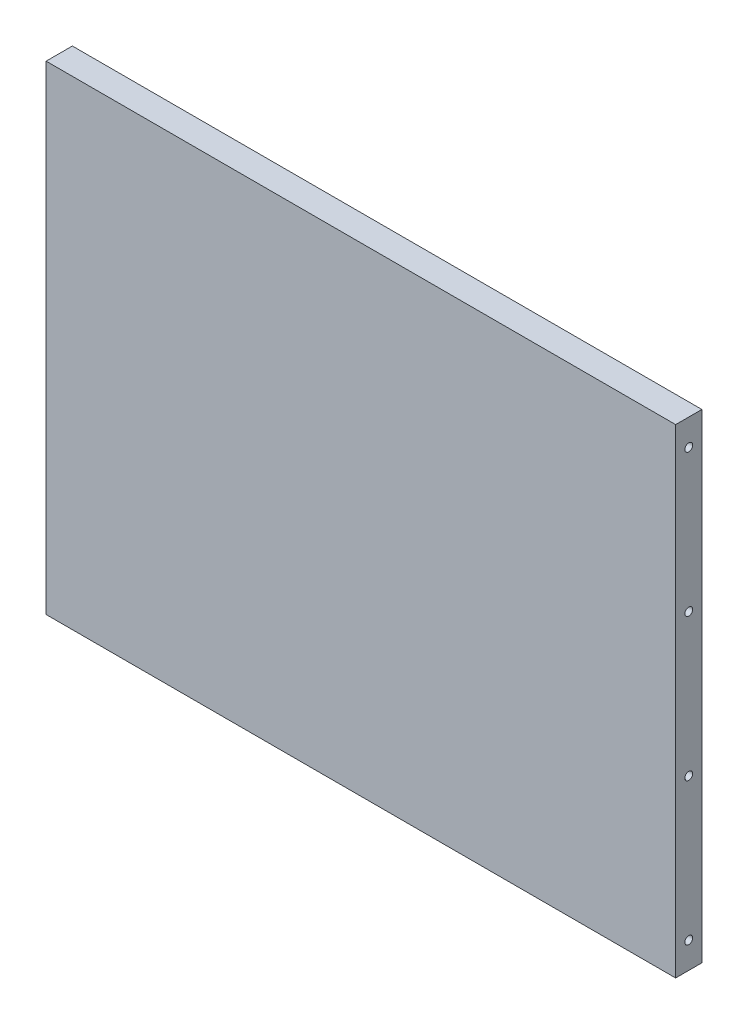
ISO-10303-21;
HEADER;
FILE_DESCRIPTION(('STEP AP214'),'2;1');
FILE_NAME('part.step','',(''),(''),'','','');
FILE_SCHEMA(('AUTOMOTIVE_DESIGN { 1 0 10303 214 1 1 1 1 }'));
ENDSEC;
DATA;
#1=APPLICATION_CONTEXT('core data for automotive mechanical design processes');
#2=APPLICATION_PROTOCOL_DEFINITION('international standard','automotive_design',2000,#1);
#3=PRODUCT_CONTEXT('',#1,'mechanical');
#4=PRODUCT('Part','Part','',(#3));
#5=PRODUCT_RELATED_PRODUCT_CATEGORY('part','',(#4));
#6=PRODUCT_DEFINITION_FORMATION('','',#4);
#7=PRODUCT_DEFINITION_CONTEXT('part definition',#1,'design');
#8=PRODUCT_DEFINITION('design','',#6,#7);
#9=PRODUCT_DEFINITION_SHAPE('','',#8);
#10=(LENGTH_UNIT() NAMED_UNIT(*) SI_UNIT(.MILLI.,.METRE.));
#11=(NAMED_UNIT(*) PLANE_ANGLE_UNIT() SI_UNIT($,.RADIAN.));
#12=(NAMED_UNIT(*) SI_UNIT($,.STERADIAN.) SOLID_ANGLE_UNIT());
#13=UNCERTAINTY_MEASURE_WITH_UNIT(LENGTH_MEASURE(1.E-05),#10,'distance_accuracy_value','');
#14=(GEOMETRIC_REPRESENTATION_CONTEXT(3) GLOBAL_UNCERTAINTY_ASSIGNED_CONTEXT((#13)) GLOBAL_UNIT_ASSIGNED_CONTEXT((#10,
#11,#12)) REPRESENTATION_CONTEXT('',''));
#15=CARTESIAN_POINT('',(0.,0.,0.));
#16=DIRECTION('',(0.,0.,1.));
#17=DIRECTION('',(1.,0.,0.));
#18=AXIS2_PLACEMENT_3D('',#15,#16,#17);
#19=CARTESIAN_POINT('',(-152.39999933097,-116.025,-12.7));
#20=DIRECTION('',(-1.,0.,0.));
#21=DIRECTION('',(0.,0.,1.));
#22=AXIS2_PLACEMENT_3D('',#19,#20,#21);
#23=PLANE('',#22);
#24=CARTESIAN_POINT('',(-152.39999933097,103.325,-6.34999999999997));
#25=DIRECTION('',(-1.,0.,0.));
#26=DIRECTION('',(0.,0.,1.));
#27=AXIS2_PLACEMENT_3D('',#24,#25,#26);
#28=CIRCLE('',#27,1.89864999999999);
#29=CARTESIAN_POINT('',(-152.39999933097,103.325,-4.45134999999998));
#30=VERTEX_POINT('',#29);
#31=EDGE_CURVE('E154',#30,#30,#28,.T.);
#32=ORIENTED_EDGE('',*,*,#31,.F.);
#33=EDGE_LOOP('',(#32));
#34=FACE_BOUND('',#33,.T.);
#35=CARTESIAN_POINT('',(-152.39999933097,34.4416666666666,-6.34999999999997));
#36=DIRECTION('',(-1.,0.,0.));
#37=DIRECTION('',(0.,0.,1.));
#38=AXIS2_PLACEMENT_3D('',#35,#36,#37);
#39=CIRCLE('',#38,1.89864999999999);
#40=CARTESIAN_POINT('',(-152.39999933097,34.4416666666666,-4.45134999999998));
#41=VERTEX_POINT('',#40);
#42=EDGE_CURVE('E160',#41,#41,#39,.T.);
#43=ORIENTED_EDGE('',*,*,#42,.F.);
#44=EDGE_LOOP('',(#43));
#45=FACE_BOUND('',#44,.T.);
#46=CARTESIAN_POINT('',(-152.39999933097,-34.4416666666667,-6.34999999999997));
#47=DIRECTION('',(-1.,0.,0.));
#48=DIRECTION('',(0.,0.,1.));
#49=AXIS2_PLACEMENT_3D('',#46,#47,#48);
#50=CIRCLE('',#49,1.89864999999999);
#51=CARTESIAN_POINT('',(-152.39999933097,-34.4416666666667,-4.45134999999998));
#52=VERTEX_POINT('',#51);
#53=EDGE_CURVE('E166',#52,#52,#50,.T.);
#54=ORIENTED_EDGE('',*,*,#53,.F.);
#55=EDGE_LOOP('',(#54));
#56=FACE_BOUND('',#55,.T.);
#57=CARTESIAN_POINT('',(-152.39999933097,-103.325,-6.34999999999997));
#58=DIRECTION('',(-1.,0.,0.));
#59=DIRECTION('',(0.,0.,1.));
#60=AXIS2_PLACEMENT_3D('',#57,#58,#59);
#61=CIRCLE('',#60,1.89864999999999);
#62=CARTESIAN_POINT('',(-152.39999933097,-103.325,-4.45134999999998));
#63=VERTEX_POINT('',#62);
#64=EDGE_CURVE('E172',#63,#63,#61,.T.);
#65=ORIENTED_EDGE('',*,*,#64,.F.);
#66=EDGE_LOOP('',(#65));
#67=FACE_BOUND('',#66,.T.);
#68=DIRECTION('',(0.,-1.,0.));
#69=VECTOR('',#68,1.);
#70=CARTESIAN_POINT('',(-152.39999933097,-116.025,0.));
#71=LINE('',#70,#69);
#72=CARTESIAN_POINT('',(-152.39999933097,116.025,0.));
#73=VERTEX_POINT('',#72);
#74=CARTESIAN_POINT('',(-152.39999933097,-116.025,0.));
#75=VERTEX_POINT('',#74);
#76=EDGE_CURVE('E178',#73,#75,#71,.T.);
#77=ORIENTED_EDGE('',*,*,#76,.F.);
#78=DIRECTION('',(0.,0.,1.));
#79=VECTOR('',#78,1.);
#80=CARTESIAN_POINT('',(-152.39999933097,116.025,-12.7));
#81=LINE('',#80,#79);
#82=CARTESIAN_POINT('',(-152.39999933097,116.025,-12.7));
#83=VERTEX_POINT('',#82);
#84=EDGE_CURVE('E11',#83,#73,#81,.T.);
#85=ORIENTED_EDGE('',*,*,#84,.F.);
#86=DIRECTION('',(0.,-1.,0.));
#87=VECTOR('',#86,1.);
#88=CARTESIAN_POINT('',(-152.39999933097,-116.025,-12.7));
#89=LINE('',#88,#87);
#90=CARTESIAN_POINT('',(-152.39999933097,-116.025,-12.7));
#91=VERTEX_POINT('',#90);
#92=EDGE_CURVE('E179',#83,#91,#89,.T.);
#93=ORIENTED_EDGE('',*,*,#92,.T.);
#94=DIRECTION('',(0.,0.,1.));
#95=VECTOR('',#94,1.);
#96=CARTESIAN_POINT('',(-152.39999933097,-116.025,-12.7));
#97=LINE('',#96,#95);
#98=EDGE_CURVE('E54',#91,#75,#97,.T.);
#99=ORIENTED_EDGE('',*,*,#98,.T.);
#100=EDGE_LOOP('',(#77,#85,#93,#99));
#101=FACE_BOUND('',#100,.T.);
#102=ADVANCED_FACE('F51',(#34,#45,#56,#67,#101),#23,.T.);
#103=CARTESIAN_POINT('',(-152.39999933097,116.025,-12.7));
#104=DIRECTION('',(0.,1.,0.));
#105=DIRECTION('',(0.,0.,1.));
#106=AXIS2_PLACEMENT_3D('',#103,#104,#105);
#107=PLANE('',#106);
#108=DIRECTION('',(-1.,0.,0.));
#109=VECTOR('',#108,1.);
#110=CARTESIAN_POINT('',(-152.39999933097,116.025,0.));
#111=LINE('',#110,#109);
#112=CARTESIAN_POINT('',(152.39999933097,116.025,0.));
#113=VERTEX_POINT('',#112);
#114=EDGE_CURVE('E182',#113,#73,#111,.T.);
#115=ORIENTED_EDGE('',*,*,#114,.F.);
#116=DIRECTION('',(0.,0.,1.));
#117=VECTOR('',#116,1.);
#118=CARTESIAN_POINT('',(152.39999933097,116.025,-12.7));
#119=LINE('',#118,#117);
#120=CARTESIAN_POINT('',(152.39999933097,116.025,-12.7));
#121=VERTEX_POINT('',#120);
#122=EDGE_CURVE('E60',#121,#113,#119,.T.);
#123=ORIENTED_EDGE('',*,*,#122,.F.);
#124=DIRECTION('',(-1.,0.,0.));
#125=VECTOR('',#124,1.);
#126=CARTESIAN_POINT('',(-152.39999933097,116.025,-12.7));
#127=LINE('',#126,#125);
#128=EDGE_CURVE('E186',#121,#83,#127,.T.);
#129=ORIENTED_EDGE('',*,*,#128,.T.);
#130=ORIENTED_EDGE('',*,*,#84,.T.);
#131=EDGE_LOOP('',(#115,#123,#129,#130));
#132=FACE_BOUND('',#131,.T.);
#133=ADVANCED_FACE('F201',(#132),#107,.T.);
#134=CARTESIAN_POINT('',(152.39999933097,-116.025,-12.7));
#135=DIRECTION('',(1.,0.,0.));
#136=DIRECTION('',(0.,0.,-1.));
#137=AXIS2_PLACEMENT_3D('',#134,#135,#136);
#138=PLANE('',#137);
#139=CARTESIAN_POINT('',(152.39999933097,103.325,-6.34999999999997));
#140=DIRECTION('',(1.,0.,0.));
#141=DIRECTION('',(0.,0.,-1.));
#142=AXIS2_PLACEMENT_3D('',#139,#140,#141);
#143=CIRCLE('',#142,1.89864999999999);
#144=CARTESIAN_POINT('',(152.39999933097,103.325,-8.24864999999996));
#145=VERTEX_POINT('',#144);
#146=EDGE_CURVE('E132',#145,#145,#143,.T.);
#147=ORIENTED_EDGE('',*,*,#146,.F.);
#148=EDGE_LOOP('',(#147));
#149=FACE_BOUND('',#148,.T.);
#150=CARTESIAN_POINT('',(152.39999933097,34.4416666666666,-6.34999999999997));
#151=DIRECTION('',(1.,0.,0.));
#152=DIRECTION('',(0.,0.,-1.));
#153=AXIS2_PLACEMENT_3D('',#150,#151,#152);
#154=CIRCLE('',#153,1.89864999999999);
#155=CARTESIAN_POINT('',(152.39999933097,34.4416666666666,-8.24864999999996));
#156=VERTEX_POINT('',#155);
#157=EDGE_CURVE('E131',#156,#156,#154,.T.);
#158=ORIENTED_EDGE('',*,*,#157,.F.);
#159=EDGE_LOOP('',(#158));
#160=FACE_BOUND('',#159,.T.);
#161=CARTESIAN_POINT('',(152.39999933097,-34.4416666666667,-6.34999999999997));
#162=DIRECTION('',(1.,0.,0.));
#163=DIRECTION('',(0.,0.,-1.));
#164=AXIS2_PLACEMENT_3D('',#161,#162,#163);
#165=CIRCLE('',#164,1.89864999999999);
#166=CARTESIAN_POINT('',(152.39999933097,-34.4416666666667,-8.24864999999996));
#167=VERTEX_POINT('',#166);
#168=EDGE_CURVE('E142',#167,#167,#165,.T.);
#169=ORIENTED_EDGE('',*,*,#168,.F.);
#170=EDGE_LOOP('',(#169));
#171=FACE_BOUND('',#170,.T.);
#172=CARTESIAN_POINT('',(152.39999933097,-103.325,-6.34999999999997));
#173=DIRECTION('',(1.,0.,0.));
#174=DIRECTION('',(0.,0.,-1.));
#175=AXIS2_PLACEMENT_3D('',#172,#173,#174);
#176=CIRCLE('',#175,1.89864999999999);
#177=CARTESIAN_POINT('',(152.39999933097,-103.325,-8.24864999999996));
#178=VERTEX_POINT('',#177);
#179=EDGE_CURVE('E148',#178,#178,#176,.T.);
#180=ORIENTED_EDGE('',*,*,#179,.F.);
#181=EDGE_LOOP('',(#180));
#182=FACE_BOUND('',#181,.T.);
#183=DIRECTION('',(0.,1.,0.));
#184=VECTOR('',#183,1.);
#185=CARTESIAN_POINT('',(152.39999933097,-116.025,0.));
#186=LINE('',#185,#184);
#187=CARTESIAN_POINT('',(152.39999933097,-116.025,0.));
#188=VERTEX_POINT('',#187);
#189=EDGE_CURVE('E193',#188,#113,#186,.T.);
#190=ORIENTED_EDGE('',*,*,#189,.F.);
#191=DIRECTION('',(0.,0.,1.));
#192=VECTOR('',#191,1.);
#193=CARTESIAN_POINT('',(152.39999933097,-116.025,-12.7));
#194=LINE('',#193,#192);
#195=CARTESIAN_POINT('',(152.39999933097,-116.025,-12.7));
#196=VERTEX_POINT('',#195);
#197=EDGE_CURVE('E197',#196,#188,#194,.T.);
#198=ORIENTED_EDGE('',*,*,#197,.F.);
#199=DIRECTION('',(0.,1.,0.));
#200=VECTOR('',#199,1.);
#201=CARTESIAN_POINT('',(152.39999933097,-116.025,-12.7));
#202=LINE('',#201,#200);
#203=EDGE_CURVE('E184',#196,#121,#202,.T.);
#204=ORIENTED_EDGE('',*,*,#203,.T.);
#205=ORIENTED_EDGE('',*,*,#122,.T.);
#206=EDGE_LOOP('',(#190,#198,#204,#205));
#207=FACE_BOUND('',#206,.T.);
#208=ADVANCED_FACE('F204',(#149,#160,#171,#182,#207),#138,.T.);
#209=CARTESIAN_POINT('',(-152.39999933097,-116.025,-12.7));
#210=DIRECTION('',(0.,-1.,0.));
#211=DIRECTION('',(0.,0.,-1.));
#212=AXIS2_PLACEMENT_3D('',#209,#210,#211);
#213=PLANE('',#212);
#214=DIRECTION('',(1.,0.,0.));
#215=VECTOR('',#214,1.);
#216=CARTESIAN_POINT('',(-152.39999933097,-116.025,0.));
#217=LINE('',#216,#215);
#218=EDGE_CURVE('E190',#75,#188,#217,.T.);
#219=ORIENTED_EDGE('',*,*,#218,.F.);
#220=ORIENTED_EDGE('',*,*,#98,.F.);
#221=DIRECTION('',(1.,0.,0.));
#222=VECTOR('',#221,1.);
#223=CARTESIAN_POINT('',(-152.39999933097,-116.025,-12.7));
#224=LINE('',#223,#222);
#225=EDGE_CURVE('E181',#91,#196,#224,.T.);
#226=ORIENTED_EDGE('',*,*,#225,.T.);
#227=ORIENTED_EDGE('',*,*,#197,.T.);
#228=EDGE_LOOP('',(#219,#220,#226,#227));
#229=FACE_BOUND('',#228,.T.);
#230=ADVANCED_FACE('F198',(#229),#213,.T.);
#231=CARTESIAN_POINT('',(0.,0.,-12.7));
#232=DIRECTION('',(0.,0.,-1.));
#233=DIRECTION('',(-1.,0.,0.));
#234=AXIS2_PLACEMENT_3D('',#231,#232,#233);
#235=PLANE('',#234);
#236=ORIENTED_EDGE('',*,*,#92,.F.);
#237=ORIENTED_EDGE('',*,*,#128,.F.);
#238=ORIENTED_EDGE('',*,*,#203,.F.);
#239=ORIENTED_EDGE('',*,*,#225,.F.);
#240=EDGE_LOOP('',(#236,#237,#238,#239));
#241=FACE_BOUND('',#240,.T.);
#242=ADVANCED_FACE('F206',(#241),#235,.T.);
#243=CARTESIAN_POINT('',(0.,0.,0.));
#244=DIRECTION('',(0.,0.,-1.));
#245=DIRECTION('',(-1.,0.,0.));
#246=AXIS2_PLACEMENT_3D('',#243,#244,#245);
#247=PLANE('',#246);
#248=ORIENTED_EDGE('',*,*,#76,.T.);
#249=ORIENTED_EDGE('',*,*,#218,.T.);
#250=ORIENTED_EDGE('',*,*,#189,.T.);
#251=ORIENTED_EDGE('',*,*,#114,.T.);
#252=EDGE_LOOP('',(#248,#249,#250,#251));
#253=FACE_BOUND('',#252,.T.);
#254=ADVANCED_FACE('F200',(#253),#247,.F.);
#255=CARTESIAN_POINT('',(-133.34999933097,-103.325,-6.34999999999997));
#256=DIRECTION('',(-1.,0.,0.));
#257=DIRECTION('',(0.,0.,1.));
#258=AXIS2_PLACEMENT_3D('',#255,#256,#257);
#259=CONICAL_SURFACE('',#258,1.89864999999999,1.02974425867664);
#260=CARTESIAN_POINT('',(-132.209175316654,-103.325,-6.34999999999997));
#261=VERTEX_POINT('',#260);
#262=VERTEX_LOOP('',#261);
#263=FACE_BOUND('',#262,.T.);
#264=CARTESIAN_POINT('',(-133.34999933097,-103.325,-6.34999999999997));
#265=DIRECTION('',(-1.,0.,0.));
#266=DIRECTION('',(0.,0.,1.));
#267=AXIS2_PLACEMENT_3D('',#264,#265,#266);
#268=CIRCLE('',#267,1.89864999999999);
#269=CARTESIAN_POINT('',(-133.34999933097,-103.325,-4.45134999999998));
#270=VERTEX_POINT('',#269);
#271=EDGE_CURVE('E175',#270,#270,#268,.T.);
#272=ORIENTED_EDGE('',*,*,#271,.T.);
#273=EDGE_LOOP('',(#272));
#274=FACE_BOUND('',#273,.T.);
#275=ADVANCED_FACE('F213',(#263,#274),#259,.F.);
#276=CARTESIAN_POINT('',(-152.39999933097,-103.325,-6.34999999999997));
#277=DIRECTION('',(-1.,0.,0.));
#278=DIRECTION('',(0.,0.,1.));
#279=AXIS2_PLACEMENT_3D('',#276,#277,#278);
#280=CYLINDRICAL_SURFACE('',#279,1.89864999999999);
#281=ORIENTED_EDGE('',*,*,#271,.F.);
#282=EDGE_LOOP('',(#281));
#283=FACE_BOUND('',#282,.T.);
#284=ORIENTED_EDGE('',*,*,#64,.T.);
#285=EDGE_LOOP('',(#284));
#286=FACE_BOUND('',#285,.T.);
#287=ADVANCED_FACE('F231',(#283,#286),#280,.F.);
#288=CARTESIAN_POINT('',(-133.34999933097,-34.4416666666667,-6.34999999999997));
#289=DIRECTION('',(-1.,0.,0.));
#290=DIRECTION('',(0.,0.,1.));
#291=AXIS2_PLACEMENT_3D('',#288,#289,#290);
#292=CONICAL_SURFACE('',#291,1.89864999999999,1.02974425867664);
#293=CARTESIAN_POINT('',(-132.209175316654,-34.4416666666667,-6.34999999999997));
#294=VERTEX_POINT('',#293);
#295=VERTEX_LOOP('',#294);
#296=FACE_BOUND('',#295,.T.);
#297=CARTESIAN_POINT('',(-133.34999933097,-34.4416666666667,-6.34999999999997));
#298=DIRECTION('',(-1.,0.,0.));
#299=DIRECTION('',(0.,0.,1.));
#300=AXIS2_PLACEMENT_3D('',#297,#298,#299);
#301=CIRCLE('',#300,1.89864999999999);
#302=CARTESIAN_POINT('',(-133.34999933097,-34.4416666666667,-4.45134999999998));
#303=VERTEX_POINT('',#302);
#304=EDGE_CURVE('E169',#303,#303,#301,.T.);
#305=ORIENTED_EDGE('',*,*,#304,.T.);
#306=EDGE_LOOP('',(#305));
#307=FACE_BOUND('',#306,.T.);
#308=ADVANCED_FACE('F233',(#296,#307),#292,.F.);
#309=CARTESIAN_POINT('',(-152.39999933097,-34.4416666666667,-6.34999999999997));
#310=DIRECTION('',(-1.,0.,0.));
#311=DIRECTION('',(0.,0.,1.));
#312=AXIS2_PLACEMENT_3D('',#309,#310,#311);
#313=CYLINDRICAL_SURFACE('',#312,1.89864999999999);
#314=ORIENTED_EDGE('',*,*,#304,.F.);
#315=EDGE_LOOP('',(#314));
#316=FACE_BOUND('',#315,.T.);
#317=ORIENTED_EDGE('',*,*,#53,.T.);
#318=EDGE_LOOP('',(#317));
#319=FACE_BOUND('',#318,.T.);
#320=ADVANCED_FACE('F240',(#316,#319),#313,.F.);
#321=CARTESIAN_POINT('',(-133.34999933097,34.4416666666666,-6.34999999999997));
#322=DIRECTION('',(-1.,0.,0.));
#323=DIRECTION('',(0.,0.,1.));
#324=AXIS2_PLACEMENT_3D('',#321,#322,#323);
#325=CONICAL_SURFACE('',#324,1.89864999999999,1.02974425867664);
#326=CARTESIAN_POINT('',(-132.209175316654,34.4416666666666,-6.34999999999997));
#327=VERTEX_POINT('',#326);
#328=VERTEX_LOOP('',#327);
#329=FACE_BOUND('',#328,.T.);
#330=CARTESIAN_POINT('',(-133.34999933097,34.4416666666666,-6.34999999999997));
#331=DIRECTION('',(-1.,0.,0.));
#332=DIRECTION('',(0.,0.,1.));
#333=AXIS2_PLACEMENT_3D('',#330,#331,#332);
#334=CIRCLE('',#333,1.89864999999999);
#335=CARTESIAN_POINT('',(-133.34999933097,34.4416666666666,-4.45134999999998));
#336=VERTEX_POINT('',#335);
#337=EDGE_CURVE('E163',#336,#336,#334,.T.);
#338=ORIENTED_EDGE('',*,*,#337,.T.);
#339=EDGE_LOOP('',(#338));
#340=FACE_BOUND('',#339,.T.);
#341=ADVANCED_FACE('F248',(#329,#340),#325,.F.);
#342=CARTESIAN_POINT('',(-152.39999933097,34.4416666666666,-6.34999999999997));
#343=DIRECTION('',(-1.,0.,0.));
#344=DIRECTION('',(0.,0.,1.));
#345=AXIS2_PLACEMENT_3D('',#342,#343,#344);
#346=CYLINDRICAL_SURFACE('',#345,1.89864999999999);
#347=ORIENTED_EDGE('',*,*,#337,.F.);
#348=EDGE_LOOP('',(#347));
#349=FACE_BOUND('',#348,.T.);
#350=ORIENTED_EDGE('',*,*,#42,.T.);
#351=EDGE_LOOP('',(#350));
#352=FACE_BOUND('',#351,.T.);
#353=ADVANCED_FACE('F252',(#349,#352),#346,.F.);
#354=CARTESIAN_POINT('',(-133.34999933097,103.325,-6.34999999999997));
#355=DIRECTION('',(-1.,0.,0.));
#356=DIRECTION('',(0.,0.,1.));
#357=AXIS2_PLACEMENT_3D('',#354,#355,#356);
#358=CONICAL_SURFACE('',#357,1.89864999999999,1.02974425867664);
#359=CARTESIAN_POINT('',(-132.209175316654,103.325,-6.34999999999997));
#360=VERTEX_POINT('',#359);
#361=VERTEX_LOOP('',#360);
#362=FACE_BOUND('',#361,.T.);
#363=CARTESIAN_POINT('',(-133.34999933097,103.325,-6.34999999999997));
#364=DIRECTION('',(-1.,0.,0.));
#365=DIRECTION('',(0.,0.,1.));
#366=AXIS2_PLACEMENT_3D('',#363,#364,#365);
#367=CIRCLE('',#366,1.89864999999999);
#368=CARTESIAN_POINT('',(-133.34999933097,103.325,-4.45134999999998));
#369=VERTEX_POINT('',#368);
#370=EDGE_CURVE('E157',#369,#369,#367,.T.);
#371=ORIENTED_EDGE('',*,*,#370,.T.);
#372=EDGE_LOOP('',(#371));
#373=FACE_BOUND('',#372,.T.);
#374=ADVANCED_FACE('F256',(#362,#373),#358,.F.);
#375=CARTESIAN_POINT('',(-152.39999933097,103.325,-6.34999999999997));
#376=DIRECTION('',(-1.,0.,0.));
#377=DIRECTION('',(0.,0.,1.));
#378=AXIS2_PLACEMENT_3D('',#375,#376,#377);
#379=CYLINDRICAL_SURFACE('',#378,1.89864999999999);
#380=ORIENTED_EDGE('',*,*,#370,.F.);
#381=EDGE_LOOP('',(#380));
#382=FACE_BOUND('',#381,.T.);
#383=ORIENTED_EDGE('',*,*,#31,.T.);
#384=EDGE_LOOP('',(#383));
#385=FACE_BOUND('',#384,.T.);
#386=ADVANCED_FACE('F260',(#382,#385),#379,.F.);
#387=CARTESIAN_POINT('',(133.34999933097,-103.325,-6.34999999999997));
#388=DIRECTION('',(1.,0.,0.));
#389=DIRECTION('',(0.,0.,-1.));
#390=AXIS2_PLACEMENT_3D('',#387,#388,#389);
#391=CONICAL_SURFACE('',#390,1.89864999999999,1.02974425867664);
#392=CARTESIAN_POINT('',(132.209175316654,-103.325,-6.34999999999997));
#393=VERTEX_POINT('',#392);
#394=VERTEX_LOOP('',#393);
#395=FACE_BOUND('',#394,.T.);
#396=CARTESIAN_POINT('',(133.34999933097,-103.325,-6.34999999999997));
#397=DIRECTION('',(1.,0.,0.));
#398=DIRECTION('',(0.,0.,-1.));
#399=AXIS2_PLACEMENT_3D('',#396,#397,#398);
#400=CIRCLE('',#399,1.89864999999999);
#401=CARTESIAN_POINT('',(133.34999933097,-103.325,-8.24864999999996));
#402=VERTEX_POINT('',#401);
#403=EDGE_CURVE('E151',#402,#402,#400,.T.);
#404=ORIENTED_EDGE('',*,*,#403,.T.);
#405=EDGE_LOOP('',(#404));
#406=FACE_BOUND('',#405,.T.);
#407=ADVANCED_FACE('F264',(#395,#406),#391,.F.);
#408=CARTESIAN_POINT('',(152.39999933097,-103.325,-6.34999999999997));
#409=DIRECTION('',(1.,0.,0.));
#410=DIRECTION('',(0.,0.,-1.));
#411=AXIS2_PLACEMENT_3D('',#408,#409,#410);
#412=CYLINDRICAL_SURFACE('',#411,1.89864999999999);
#413=ORIENTED_EDGE('',*,*,#403,.F.);
#414=EDGE_LOOP('',(#413));
#415=FACE_BOUND('',#414,.T.);
#416=ORIENTED_EDGE('',*,*,#179,.T.);
#417=EDGE_LOOP('',(#416));
#418=FACE_BOUND('',#417,.T.);
#419=ADVANCED_FACE('F268',(#415,#418),#412,.F.);
#420=CARTESIAN_POINT('',(133.34999933097,-34.4416666666667,-6.34999999999997));
#421=DIRECTION('',(1.,0.,0.));
#422=DIRECTION('',(0.,0.,-1.));
#423=AXIS2_PLACEMENT_3D('',#420,#421,#422);
#424=CONICAL_SURFACE('',#423,1.89864999999999,1.02974425867664);
#425=CARTESIAN_POINT('',(132.209175316654,-34.4416666666667,-6.34999999999997));
#426=VERTEX_POINT('',#425);
#427=VERTEX_LOOP('',#426);
#428=FACE_BOUND('',#427,.T.);
#429=CARTESIAN_POINT('',(133.34999933097,-34.4416666666667,-6.34999999999997));
#430=DIRECTION('',(1.,0.,0.));
#431=DIRECTION('',(0.,0.,-1.));
#432=AXIS2_PLACEMENT_3D('',#429,#430,#431);
#433=CIRCLE('',#432,1.89864999999999);
#434=CARTESIAN_POINT('',(133.34999933097,-34.4416666666667,-8.24864999999996));
#435=VERTEX_POINT('',#434);
#436=EDGE_CURVE('E145',#435,#435,#433,.T.);
#437=ORIENTED_EDGE('',*,*,#436,.T.);
#438=EDGE_LOOP('',(#437));
#439=FACE_BOUND('',#438,.T.);
#440=ADVANCED_FACE('F272',(#428,#439),#424,.F.);
#441=CARTESIAN_POINT('',(152.39999933097,-34.4416666666667,-6.34999999999997));
#442=DIRECTION('',(1.,0.,0.));
#443=DIRECTION('',(0.,0.,-1.));
#444=AXIS2_PLACEMENT_3D('',#441,#442,#443);
#445=CYLINDRICAL_SURFACE('',#444,1.89864999999999);
#446=ORIENTED_EDGE('',*,*,#436,.F.);
#447=EDGE_LOOP('',(#446));
#448=FACE_BOUND('',#447,.T.);
#449=ORIENTED_EDGE('',*,*,#168,.T.);
#450=EDGE_LOOP('',(#449));
#451=FACE_BOUND('',#450,.T.);
#452=ADVANCED_FACE('F276',(#448,#451),#445,.F.);
#453=CARTESIAN_POINT('',(133.34999933097,34.4416666666666,-6.34999999999997));
#454=DIRECTION('',(1.,0.,0.));
#455=DIRECTION('',(0.,0.,-1.));
#456=AXIS2_PLACEMENT_3D('',#453,#454,#455);
#457=CONICAL_SURFACE('',#456,1.89864999999999,1.02974425867664);
#458=CARTESIAN_POINT('',(132.209175316654,34.4416666666666,-6.34999999999997));
#459=VERTEX_POINT('',#458);
#460=VERTEX_LOOP('',#459);
#461=FACE_BOUND('',#460,.T.);
#462=CARTESIAN_POINT('',(133.34999933097,34.4416666666666,-6.34999999999997));
#463=DIRECTION('',(1.,0.,0.));
#464=DIRECTION('',(0.,0.,-1.));
#465=AXIS2_PLACEMENT_3D('',#462,#463,#464);
#466=CIRCLE('',#465,1.89864999999999);
#467=CARTESIAN_POINT('',(133.34999933097,34.4416666666666,-8.24864999999996));
#468=VERTEX_POINT('',#467);
#469=EDGE_CURVE('E135',#468,#468,#466,.T.);
#470=ORIENTED_EDGE('',*,*,#469,.T.);
#471=EDGE_LOOP('',(#470));
#472=FACE_BOUND('',#471,.T.);
#473=ADVANCED_FACE('F280',(#461,#472),#457,.F.);
#474=CARTESIAN_POINT('',(152.39999933097,34.4416666666666,-6.34999999999997));
#475=DIRECTION('',(1.,0.,0.));
#476=DIRECTION('',(0.,0.,-1.));
#477=AXIS2_PLACEMENT_3D('',#474,#475,#476);
#478=CYLINDRICAL_SURFACE('',#477,1.89864999999999);
#479=ORIENTED_EDGE('',*,*,#469,.F.);
#480=EDGE_LOOP('',(#479));
#481=FACE_BOUND('',#480,.T.);
#482=ORIENTED_EDGE('',*,*,#157,.T.);
#483=EDGE_LOOP('',(#482));
#484=FACE_BOUND('',#483,.T.);
#485=ADVANCED_FACE('F125',(#481,#484),#478,.F.);
#486=CARTESIAN_POINT('',(133.34999933097,103.325,-6.34999999999997));
#487=DIRECTION('',(1.,0.,0.));
#488=DIRECTION('',(0.,0.,-1.));
#489=AXIS2_PLACEMENT_3D('',#486,#487,#488);
#490=CONICAL_SURFACE('',#489,1.89864999999999,1.02974425867664);
#491=CARTESIAN_POINT('',(132.209175316654,103.325,-6.34999999999997));
#492=VERTEX_POINT('',#491);
#493=VERTEX_LOOP('',#492);
#494=FACE_BOUND('',#493,.T.);
#495=CARTESIAN_POINT('',(133.34999933097,103.325,-6.34999999999997));
#496=DIRECTION('',(1.,0.,0.));
#497=DIRECTION('',(0.,0.,-1.));
#498=AXIS2_PLACEMENT_3D('',#495,#496,#497);
#499=CIRCLE('',#498,1.89864999999999);
#500=CARTESIAN_POINT('',(133.34999933097,103.325,-8.24864999999996));
#501=VERTEX_POINT('',#500);
#502=EDGE_CURVE('E129',#501,#501,#499,.T.);
#503=ORIENTED_EDGE('',*,*,#502,.T.);
#504=EDGE_LOOP('',(#503));
#505=FACE_BOUND('',#504,.T.);
#506=ADVANCED_FACE('F121',(#494,#505),#490,.F.);
#507=CARTESIAN_POINT('',(152.39999933097,103.325,-6.34999999999997));
#508=DIRECTION('',(1.,0.,0.));
#509=DIRECTION('',(0.,0.,-1.));
#510=AXIS2_PLACEMENT_3D('',#507,#508,#509);
#511=CYLINDRICAL_SURFACE('',#510,1.89864999999999);
#512=ORIENTED_EDGE('',*,*,#502,.F.);
#513=EDGE_LOOP('',(#512));
#514=FACE_BOUND('',#513,.T.);
#515=ORIENTED_EDGE('',*,*,#146,.T.);
#516=EDGE_LOOP('',(#515));
#517=FACE_BOUND('',#516,.T.);
#518=ADVANCED_FACE('F124',(#514,#517),#511,.F.);
#519=CLOSED_SHELL('',(#102,#133,#208,#230,#242,#254,#275,#287,#308,#320,#341,#353,#374,#386,
#407,#419,#440,#452,#473,#485,#506,#518));
#520=MANIFOLD_SOLID_BREP('B2',#519);
#521=ADVANCED_BREP_SHAPE_REPRESENTATION('',(#18,#520),#14);
#522=SHAPE_DEFINITION_REPRESENTATION(#9,#521);
ENDSEC;
END-ISO-10303-21;
